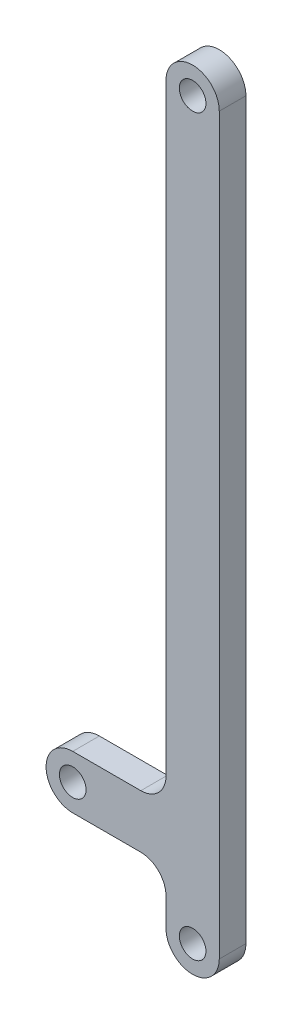
ISO-10303-21;
HEADER;
FILE_DESCRIPTION(('STEP AP214'),'2;1');
FILE_NAME('part.step','',(''),(''),'','','');
FILE_SCHEMA(('AUTOMOTIVE_DESIGN { 1 0 10303 214 1 1 1 1 }'));
ENDSEC;
DATA;
#1=APPLICATION_CONTEXT('core data for automotive mechanical design processes');
#2=APPLICATION_PROTOCOL_DEFINITION('international standard','automotive_design',2000,#1);
#3=PRODUCT_CONTEXT('',#1,'mechanical');
#4=PRODUCT('Part','Part','',(#3));
#5=PRODUCT_RELATED_PRODUCT_CATEGORY('part','',(#4));
#6=PRODUCT_DEFINITION_FORMATION('','',#4);
#7=PRODUCT_DEFINITION_CONTEXT('part definition',#1,'design');
#8=PRODUCT_DEFINITION('design','',#6,#7);
#9=PRODUCT_DEFINITION_SHAPE('','',#8);
#10=(LENGTH_UNIT() NAMED_UNIT(*) SI_UNIT(.MILLI.,.METRE.));
#11=(NAMED_UNIT(*) PLANE_ANGLE_UNIT() SI_UNIT($,.RADIAN.));
#12=(NAMED_UNIT(*) SI_UNIT($,.STERADIAN.) SOLID_ANGLE_UNIT());
#13=UNCERTAINTY_MEASURE_WITH_UNIT(LENGTH_MEASURE(1.E-05),#10,'distance_accuracy_value','');
#14=(GEOMETRIC_REPRESENTATION_CONTEXT(3) GLOBAL_UNCERTAINTY_ASSIGNED_CONTEXT((#13)) GLOBAL_UNIT_ASSIGNED_CONTEXT((#10,
#11,#12)) REPRESENTATION_CONTEXT('',''));
#15=CARTESIAN_POINT('',(0.,0.,0.));
#16=DIRECTION('',(0.,0.,1.));
#17=DIRECTION('',(1.,0.,0.));
#18=AXIS2_PLACEMENT_3D('',#15,#16,#17);
#19=CARTESIAN_POINT('',(0.,0.,12.7));
#20=DIRECTION('',(0.,0.,-1.));
#21=DIRECTION('',(-1.,0.,0.));
#22=AXIS2_PLACEMENT_3D('',#19,#20,#21);
#23=PLANE('',#22);
#24=CARTESIAN_POINT('',(-57.15,-311.912,12.7));
#25=DIRECTION('',(0.,0.,1.));
#26=DIRECTION('',(1.,0.,0.));
#27=AXIS2_PLACEMENT_3D('',#24,#25,#26);
#28=CIRCLE('',#27,6.34999999999999);
#29=CARTESIAN_POINT('',(-50.8,-311.912,12.7));
#30=VERTEX_POINT('',#29);
#31=EDGE_CURVE('E216',#30,#30,#28,.T.);
#32=ORIENTED_EDGE('',*,*,#31,.F.);
#33=EDGE_LOOP('',(#32));
#34=FACE_BOUND('',#33,.T.);
#35=CARTESIAN_POINT('',(0.,0.,12.7));
#36=DIRECTION('',(0.,0.,1.));
#37=DIRECTION('',(-1.,0.,0.));
#38=AXIS2_PLACEMENT_3D('',#35,#36,#37);
#39=CIRCLE('',#38,12.7);
#40=CARTESIAN_POINT('',(12.7000000000001,0.,12.7));
#41=VERTEX_POINT('',#40);
#42=CARTESIAN_POINT('',(-12.6999999999999,0.,12.7));
#43=VERTEX_POINT('',#42);
#44=EDGE_CURVE('E165',#41,#43,#39,.T.);
#45=ORIENTED_EDGE('',*,*,#44,.T.);
#46=DIRECTION('',(0.,-1.,0.));
#47=VECTOR('',#46,1.);
#48=CARTESIAN_POINT('',(-12.6999999999999,0.,12.7));
#49=LINE('',#48,#47);
#50=CARTESIAN_POINT('',(-12.7,-287.212,12.7));
#51=VERTEX_POINT('',#50);
#52=EDGE_CURVE('E103',#43,#51,#49,.T.);
#53=ORIENTED_EDGE('',*,*,#52,.T.);
#54=CARTESIAN_POINT('',(-24.7,-287.212,12.7));
#55=DIRECTION('',(0.,0.,-1.));
#56=DIRECTION('',(1.,0.,0.));
#57=AXIS2_PLACEMENT_3D('',#54,#55,#56);
#58=CIRCLE('',#57,12.);
#59=CARTESIAN_POINT('',(-24.7,-299.212,12.7));
#60=VERTEX_POINT('',#59);
#61=EDGE_CURVE('E186',#51,#60,#58,.T.);
#62=ORIENTED_EDGE('',*,*,#61,.T.);
#63=DIRECTION('',(-1.,0.,0.));
#64=VECTOR('',#63,1.);
#65=CARTESIAN_POINT('',(-24.7,-299.212,12.7));
#66=LINE('',#65,#64);
#67=CARTESIAN_POINT('',(-57.15,-299.212,12.7));
#68=VERTEX_POINT('',#67);
#69=EDGE_CURVE('E205',#60,#68,#66,.T.);
#70=ORIENTED_EDGE('',*,*,#69,.T.);
#71=CARTESIAN_POINT('',(-57.15,-311.912,12.7));
#72=DIRECTION('',(0.,0.,1.));
#73=DIRECTION('',(1.,0.,0.));
#74=AXIS2_PLACEMENT_3D('',#71,#72,#73);
#75=CIRCLE('',#74,12.7);
#76=CARTESIAN_POINT('',(-57.15,-324.612,12.7));
#77=VERTEX_POINT('',#76);
#78=EDGE_CURVE('E202',#68,#77,#75,.T.);
#79=ORIENTED_EDGE('',*,*,#78,.T.);
#80=DIRECTION('',(1.,0.,0.));
#81=VECTOR('',#80,1.);
#82=CARTESIAN_POINT('',(-24.7,-324.612,12.7));
#83=LINE('',#82,#81);
#84=CARTESIAN_POINT('',(-24.7,-324.612,12.7));
#85=VERTEX_POINT('',#84);
#86=EDGE_CURVE('E204',#77,#85,#83,.T.);
#87=ORIENTED_EDGE('',*,*,#86,.T.);
#88=CARTESIAN_POINT('',(-24.7,-336.612,12.7));
#89=DIRECTION('',(0.,0.,-1.));
#90=DIRECTION('',(1.,0.,0.));
#91=AXIS2_PLACEMENT_3D('',#88,#89,#90);
#92=CIRCLE('',#91,12.);
#93=CARTESIAN_POINT('',(-12.7,-336.612,12.7));
#94=VERTEX_POINT('',#93);
#95=EDGE_CURVE('E128',#85,#94,#92,.T.);
#96=ORIENTED_EDGE('',*,*,#95,.T.);
#97=DIRECTION('',(0.,-1.,0.));
#98=VECTOR('',#97,1.);
#99=CARTESIAN_POINT('',(-12.7,-336.612,12.7));
#100=LINE('',#99,#98);
#101=CARTESIAN_POINT('',(-12.7,-350.,12.7));
#102=VERTEX_POINT('',#101);
#103=EDGE_CURVE('E122',#94,#102,#100,.T.);
#104=ORIENTED_EDGE('',*,*,#103,.T.);
#105=CARTESIAN_POINT('',(0.,-350.,12.7));
#106=DIRECTION('',(0.,0.,1.));
#107=DIRECTION('',(1.,0.,0.));
#108=AXIS2_PLACEMENT_3D('',#105,#106,#107);
#109=CIRCLE('',#108,12.7);
#110=CARTESIAN_POINT('',(12.7,-350.,12.7));
#111=VERTEX_POINT('',#110);
#112=EDGE_CURVE('E126',#102,#111,#109,.T.);
#113=ORIENTED_EDGE('',*,*,#112,.T.);
#114=DIRECTION('',(0.,1.,0.));
#115=VECTOR('',#114,1.);
#116=CARTESIAN_POINT('',(12.7000000000001,0.,12.7));
#117=LINE('',#116,#115);
#118=EDGE_CURVE('E54',#111,#41,#117,.T.);
#119=ORIENTED_EDGE('',*,*,#118,.T.);
#120=EDGE_LOOP('',(#45,#53,#62,#70,#79,#87,#96,#104,#113,#119));
#121=FACE_BOUND('',#120,.T.);
#122=CARTESIAN_POINT('',(0.,0.,12.7));
#123=DIRECTION('',(0.,0.,1.));
#124=DIRECTION('',(1.,0.,0.));
#125=AXIS2_PLACEMENT_3D('',#122,#123,#124);
#126=CIRCLE('',#125,6.35);
#127=CARTESIAN_POINT('',(6.35000000000006,0.,12.7));
#128=VERTEX_POINT('',#127);
#129=EDGE_CURVE('E150',#128,#128,#126,.T.);
#130=ORIENTED_EDGE('',*,*,#129,.F.);
#131=EDGE_LOOP('',(#130));
#132=FACE_BOUND('',#131,.T.);
#133=CARTESIAN_POINT('',(0.,-350.,12.7));
#134=DIRECTION('',(0.,0.,1.));
#135=DIRECTION('',(1.,0.,0.));
#136=AXIS2_PLACEMENT_3D('',#133,#134,#135);
#137=CIRCLE('',#136,6.35);
#138=CARTESIAN_POINT('',(6.35,-350.,12.7));
#139=VERTEX_POINT('',#138);
#140=EDGE_CURVE('E222',#139,#139,#137,.T.);
#141=ORIENTED_EDGE('',*,*,#140,.F.);
#142=EDGE_LOOP('',(#141));
#143=FACE_BOUND('',#142,.T.);
#144=ADVANCED_FACE('F37',(#34,#121,#132,#143),#23,.F.);
#145=CARTESIAN_POINT('',(0.,0.,0.));
#146=DIRECTION('',(0.,0.,-1.));
#147=DIRECTION('',(-1.,0.,0.));
#148=AXIS2_PLACEMENT_3D('',#145,#146,#147);
#149=PLANE('',#148);
#150=CARTESIAN_POINT('',(-57.15,-311.912,0.));
#151=DIRECTION('',(0.,0.,1.));
#152=DIRECTION('',(1.,0.,0.));
#153=AXIS2_PLACEMENT_3D('',#150,#151,#152);
#154=CIRCLE('',#153,6.34999999999999);
#155=CARTESIAN_POINT('',(-50.8,-311.912,0.));
#156=VERTEX_POINT('',#155);
#157=EDGE_CURVE('E219',#156,#156,#154,.T.);
#158=ORIENTED_EDGE('',*,*,#157,.T.);
#159=EDGE_LOOP('',(#158));
#160=FACE_BOUND('',#159,.T.);
#161=CARTESIAN_POINT('',(0.,0.,0.));
#162=DIRECTION('',(0.,0.,1.));
#163=DIRECTION('',(-1.,0.,0.));
#164=AXIS2_PLACEMENT_3D('',#161,#162,#163);
#165=CIRCLE('',#164,12.7);
#166=CARTESIAN_POINT('',(12.7000000000001,0.,0.));
#167=VERTEX_POINT('',#166);
#168=CARTESIAN_POINT('',(-12.6999999999999,0.,0.));
#169=VERTEX_POINT('',#168);
#170=EDGE_CURVE('E146',#167,#169,#165,.T.);
#171=ORIENTED_EDGE('',*,*,#170,.F.);
#172=DIRECTION('',(0.,1.,0.));
#173=VECTOR('',#172,1.);
#174=CARTESIAN_POINT('',(12.7000000000001,0.,0.));
#175=LINE('',#174,#173);
#176=CARTESIAN_POINT('',(12.7,-350.,0.));
#177=VERTEX_POINT('',#176);
#178=EDGE_CURVE('E95',#177,#167,#175,.T.);
#179=ORIENTED_EDGE('',*,*,#178,.F.);
#180=CARTESIAN_POINT('',(0.,-350.,0.));
#181=DIRECTION('',(0.,0.,1.));
#182=DIRECTION('',(1.,0.,0.));
#183=AXIS2_PLACEMENT_3D('',#180,#181,#182);
#184=CIRCLE('',#183,12.7);
#185=CARTESIAN_POINT('',(-12.7,-350.,0.));
#186=VERTEX_POINT('',#185);
#187=EDGE_CURVE('E89',#186,#177,#184,.T.);
#188=ORIENTED_EDGE('',*,*,#187,.F.);
#189=DIRECTION('',(0.,-1.,0.));
#190=VECTOR('',#189,1.);
#191=CARTESIAN_POINT('',(-12.7,-336.612,0.));
#192=LINE('',#191,#190);
#193=CARTESIAN_POINT('',(-12.7,-336.612,0.));
#194=VERTEX_POINT('',#193);
#195=EDGE_CURVE('E136',#194,#186,#192,.T.);
#196=ORIENTED_EDGE('',*,*,#195,.F.);
#197=CARTESIAN_POINT('',(-24.7,-336.612,0.));
#198=DIRECTION('',(0.,0.,-1.));
#199=DIRECTION('',(1.,0.,0.));
#200=AXIS2_PLACEMENT_3D('',#197,#198,#199);
#201=CIRCLE('',#200,12.);
#202=CARTESIAN_POINT('',(-24.7,-324.612,0.));
#203=VERTEX_POINT('',#202);
#204=EDGE_CURVE('E160',#203,#194,#201,.T.);
#205=ORIENTED_EDGE('',*,*,#204,.F.);
#206=DIRECTION('',(1.,0.,0.));
#207=VECTOR('',#206,1.);
#208=CARTESIAN_POINT('',(-24.7,-324.612,0.));
#209=LINE('',#208,#207);
#210=CARTESIAN_POINT('',(-57.15,-324.612,0.));
#211=VERTEX_POINT('',#210);
#212=EDGE_CURVE('E158',#211,#203,#209,.T.);
#213=ORIENTED_EDGE('',*,*,#212,.F.);
#214=CARTESIAN_POINT('',(-57.15,-311.912,0.));
#215=DIRECTION('',(0.,0.,1.));
#216=DIRECTION('',(1.,0.,0.));
#217=AXIS2_PLACEMENT_3D('',#214,#215,#216);
#218=CIRCLE('',#217,12.7);
#219=CARTESIAN_POINT('',(-57.15,-299.212,0.));
#220=VERTEX_POINT('',#219);
#221=EDGE_CURVE('E156',#220,#211,#218,.T.);
#222=ORIENTED_EDGE('',*,*,#221,.F.);
#223=DIRECTION('',(-1.,0.,0.));
#224=VECTOR('',#223,1.);
#225=CARTESIAN_POINT('',(-24.7,-299.212,0.));
#226=LINE('',#225,#224);
#227=CARTESIAN_POINT('',(-24.7,-299.212,0.));
#228=VERTEX_POINT('',#227);
#229=EDGE_CURVE('E154',#228,#220,#226,.T.);
#230=ORIENTED_EDGE('',*,*,#229,.F.);
#231=CARTESIAN_POINT('',(-24.7,-287.212,0.));
#232=DIRECTION('',(0.,0.,-1.));
#233=DIRECTION('',(1.,0.,0.));
#234=AXIS2_PLACEMENT_3D('',#231,#232,#233);
#235=CIRCLE('',#234,12.);
#236=CARTESIAN_POINT('',(-12.7,-287.212,0.));
#237=VERTEX_POINT('',#236);
#238=EDGE_CURVE('E152',#237,#228,#235,.T.);
#239=ORIENTED_EDGE('',*,*,#238,.F.);
#240=DIRECTION('',(0.,-1.,0.));
#241=VECTOR('',#240,1.);
#242=CARTESIAN_POINT('',(-12.6999999999999,0.,0.));
#243=LINE('',#242,#241);
#244=EDGE_CURVE('E149',#169,#237,#243,.T.);
#245=ORIENTED_EDGE('',*,*,#244,.F.);
#246=EDGE_LOOP('',(#171,#179,#188,#196,#205,#213,#222,#230,#239,#245));
#247=FACE_BOUND('',#246,.T.);
#248=CARTESIAN_POINT('',(0.,0.,0.));
#249=DIRECTION('',(0.,0.,1.));
#250=DIRECTION('',(1.,0.,0.));
#251=AXIS2_PLACEMENT_3D('',#248,#249,#250);
#252=CIRCLE('',#251,6.35);
#253=CARTESIAN_POINT('',(6.35000000000006,0.,0.));
#254=VERTEX_POINT('',#253);
#255=EDGE_CURVE('E213',#254,#254,#252,.T.);
#256=ORIENTED_EDGE('',*,*,#255,.T.);
#257=EDGE_LOOP('',(#256));
#258=FACE_BOUND('',#257,.T.);
#259=CARTESIAN_POINT('',(0.,-350.,0.));
#260=DIRECTION('',(0.,0.,1.));
#261=DIRECTION('',(1.,0.,0.));
#262=AXIS2_PLACEMENT_3D('',#259,#260,#261);
#263=CIRCLE('',#262,6.35);
#264=CARTESIAN_POINT('',(6.35,-350.,0.));
#265=VERTEX_POINT('',#264);
#266=EDGE_CURVE('E225',#265,#265,#263,.T.);
#267=ORIENTED_EDGE('',*,*,#266,.T.);
#268=EDGE_LOOP('',(#267));
#269=FACE_BOUND('',#268,.T.);
#270=ADVANCED_FACE('F190',(#160,#247,#258,#269),#149,.T.);
#271=CARTESIAN_POINT('',(0.,0.,12.7));
#272=DIRECTION('',(0.,0.,-1.));
#273=DIRECTION('',(-1.,0.,0.));
#274=AXIS2_PLACEMENT_3D('',#271,#272,#273);
#275=CYLINDRICAL_SURFACE('',#274,12.7);
#276=ORIENTED_EDGE('',*,*,#170,.T.);
#277=DIRECTION('',(0.,0.,-1.));
#278=VECTOR('',#277,1.);
#279=CARTESIAN_POINT('',(-12.6999999999999,0.,12.7));
#280=LINE('',#279,#278);
#281=EDGE_CURVE('E11',#43,#169,#280,.T.);
#282=ORIENTED_EDGE('',*,*,#281,.F.);
#283=ORIENTED_EDGE('',*,*,#44,.F.);
#284=DIRECTION('',(0.,0.,-1.));
#285=VECTOR('',#284,1.);
#286=CARTESIAN_POINT('',(12.7000000000001,0.,12.7));
#287=LINE('',#286,#285);
#288=EDGE_CURVE('E142',#41,#167,#287,.T.);
#289=ORIENTED_EDGE('',*,*,#288,.T.);
#290=EDGE_LOOP('',(#276,#282,#283,#289));
#291=FACE_BOUND('',#290,.T.);
#292=ADVANCED_FACE('F39',(#291),#275,.T.);
#293=CARTESIAN_POINT('',(-12.6999999999999,0.,12.7));
#294=DIRECTION('',(1.,0.,0.));
#295=DIRECTION('',(0.,1.,0.));
#296=AXIS2_PLACEMENT_3D('',#293,#294,#295);
#297=PLANE('',#296);
#298=ORIENTED_EDGE('',*,*,#244,.T.);
#299=DIRECTION('',(0.,0.,-1.));
#300=VECTOR('',#299,1.);
#301=CARTESIAN_POINT('',(-12.7,-287.212,12.7));
#302=LINE('',#301,#300);
#303=EDGE_CURVE('E46',#51,#237,#302,.T.);
#304=ORIENTED_EDGE('',*,*,#303,.F.);
#305=ORIENTED_EDGE('',*,*,#52,.F.);
#306=ORIENTED_EDGE('',*,*,#281,.T.);
#307=EDGE_LOOP('',(#298,#304,#305,#306));
#308=FACE_BOUND('',#307,.T.);
#309=ADVANCED_FACE('F267',(#308),#297,.F.);
#310=CARTESIAN_POINT('',(-24.7,-287.212,12.7));
#311=DIRECTION('',(0.,0.,-1.));
#312=DIRECTION('',(-1.,0.,0.));
#313=AXIS2_PLACEMENT_3D('',#310,#311,#312);
#314=CYLINDRICAL_SURFACE('',#313,12.);
#315=ORIENTED_EDGE('',*,*,#238,.T.);
#316=DIRECTION('',(0.,0.,-1.));
#317=VECTOR('',#316,1.);
#318=CARTESIAN_POINT('',(-24.7,-299.212,12.7));
#319=LINE('',#318,#317);
#320=EDGE_CURVE('E178',#60,#228,#319,.T.);
#321=ORIENTED_EDGE('',*,*,#320,.F.);
#322=ORIENTED_EDGE('',*,*,#61,.F.);
#323=ORIENTED_EDGE('',*,*,#303,.T.);
#324=EDGE_LOOP('',(#315,#321,#322,#323));
#325=FACE_BOUND('',#324,.T.);
#326=ADVANCED_FACE('F184',(#325),#314,.F.);
#327=CARTESIAN_POINT('',(-24.7,-299.212,12.7));
#328=DIRECTION('',(0.,-1.,0.));
#329=DIRECTION('',(1.,0.,0.));
#330=AXIS2_PLACEMENT_3D('',#327,#328,#329);
#331=PLANE('',#330);
#332=ORIENTED_EDGE('',*,*,#229,.T.);
#333=DIRECTION('',(0.,0.,-1.));
#334=VECTOR('',#333,1.);
#335=CARTESIAN_POINT('',(-57.15,-299.212,12.7));
#336=LINE('',#335,#334);
#337=EDGE_CURVE('E175',#68,#220,#336,.T.);
#338=ORIENTED_EDGE('',*,*,#337,.F.);
#339=ORIENTED_EDGE('',*,*,#69,.F.);
#340=ORIENTED_EDGE('',*,*,#320,.T.);
#341=EDGE_LOOP('',(#332,#338,#339,#340));
#342=FACE_BOUND('',#341,.T.);
#343=ADVANCED_FACE('F196',(#342),#331,.F.);
#344=CARTESIAN_POINT('',(-57.15,-311.912,12.7));
#345=DIRECTION('',(0.,0.,-1.));
#346=DIRECTION('',(-1.,0.,0.));
#347=AXIS2_PLACEMENT_3D('',#344,#345,#346);
#348=CYLINDRICAL_SURFACE('',#347,12.7);
#349=ORIENTED_EDGE('',*,*,#221,.T.);
#350=DIRECTION('',(0.,0.,-1.));
#351=VECTOR('',#350,1.);
#352=CARTESIAN_POINT('',(-57.15,-324.612,12.7));
#353=LINE('',#352,#351);
#354=EDGE_CURVE('E172',#77,#211,#353,.T.);
#355=ORIENTED_EDGE('',*,*,#354,.F.);
#356=ORIENTED_EDGE('',*,*,#78,.F.);
#357=ORIENTED_EDGE('',*,*,#337,.T.);
#358=EDGE_LOOP('',(#349,#355,#356,#357));
#359=FACE_BOUND('',#358,.T.);
#360=ADVANCED_FACE('F200',(#359),#348,.T.);
#361=CARTESIAN_POINT('',(-24.7,-324.612,12.7));
#362=DIRECTION('',(0.,1.,0.));
#363=DIRECTION('',(0.,0.,1.));
#364=AXIS2_PLACEMENT_3D('',#361,#362,#363);
#365=PLANE('',#364);
#366=ORIENTED_EDGE('',*,*,#212,.T.);
#367=DIRECTION('',(0.,0.,-1.));
#368=VECTOR('',#367,1.);
#369=CARTESIAN_POINT('',(-24.7,-324.612,12.7));
#370=LINE('',#369,#368);
#371=EDGE_CURVE('E169',#85,#203,#370,.T.);
#372=ORIENTED_EDGE('',*,*,#371,.F.);
#373=ORIENTED_EDGE('',*,*,#86,.F.);
#374=ORIENTED_EDGE('',*,*,#354,.T.);
#375=EDGE_LOOP('',(#366,#372,#373,#374));
#376=FACE_BOUND('',#375,.T.);
#377=ADVANCED_FACE('F257',(#376),#365,.F.);
#378=CARTESIAN_POINT('',(-24.7,-336.612,12.7));
#379=DIRECTION('',(0.,0.,-1.));
#380=DIRECTION('',(-1.,0.,0.));
#381=AXIS2_PLACEMENT_3D('',#378,#379,#380);
#382=CYLINDRICAL_SURFACE('',#381,12.);
#383=ORIENTED_EDGE('',*,*,#204,.T.);
#384=DIRECTION('',(0.,0.,-1.));
#385=VECTOR('',#384,1.);
#386=CARTESIAN_POINT('',(-12.7,-336.612,12.7));
#387=LINE('',#386,#385);
#388=EDGE_CURVE('E137',#94,#194,#387,.T.);
#389=ORIENTED_EDGE('',*,*,#388,.F.);
#390=ORIENTED_EDGE('',*,*,#95,.F.);
#391=ORIENTED_EDGE('',*,*,#371,.T.);
#392=EDGE_LOOP('',(#383,#389,#390,#391));
#393=FACE_BOUND('',#392,.T.);
#394=ADVANCED_FACE('F254',(#393),#382,.F.);
#395=CARTESIAN_POINT('',(-12.7,-336.612,12.7));
#396=DIRECTION('',(1.,0.,0.));
#397=DIRECTION('',(0.,1.,0.));
#398=AXIS2_PLACEMENT_3D('',#395,#396,#397);
#399=PLANE('',#398);
#400=ORIENTED_EDGE('',*,*,#195,.T.);
#401=DIRECTION('',(0.,0.,-1.));
#402=VECTOR('',#401,1.);
#403=CARTESIAN_POINT('',(-12.7,-350.,12.7));
#404=LINE('',#403,#402);
#405=EDGE_CURVE('E133',#102,#186,#404,.T.);
#406=ORIENTED_EDGE('',*,*,#405,.F.);
#407=ORIENTED_EDGE('',*,*,#103,.F.);
#408=ORIENTED_EDGE('',*,*,#388,.T.);
#409=EDGE_LOOP('',(#400,#406,#407,#408));
#410=FACE_BOUND('',#409,.T.);
#411=ADVANCED_FACE('F134',(#410),#399,.F.);
#412=CARTESIAN_POINT('',(0.,-350.,12.7));
#413=DIRECTION('',(0.,0.,-1.));
#414=DIRECTION('',(-1.,0.,0.));
#415=AXIS2_PLACEMENT_3D('',#412,#413,#414);
#416=CYLINDRICAL_SURFACE('',#415,12.7);
#417=ORIENTED_EDGE('',*,*,#187,.T.);
#418=DIRECTION('',(0.,0.,-1.));
#419=VECTOR('',#418,1.);
#420=CARTESIAN_POINT('',(12.7,-350.,12.7));
#421=LINE('',#420,#419);
#422=EDGE_CURVE('E138',#111,#177,#421,.T.);
#423=ORIENTED_EDGE('',*,*,#422,.F.);
#424=ORIENTED_EDGE('',*,*,#112,.F.);
#425=ORIENTED_EDGE('',*,*,#405,.T.);
#426=EDGE_LOOP('',(#417,#423,#424,#425));
#427=FACE_BOUND('',#426,.T.);
#428=ADVANCED_FACE('F140',(#427),#416,.T.);
#429=CARTESIAN_POINT('',(12.7000000000001,0.,12.7));
#430=DIRECTION('',(-1.,0.,0.));
#431=DIRECTION('',(0.,-1.,0.));
#432=AXIS2_PLACEMENT_3D('',#429,#430,#431);
#433=PLANE('',#432);
#434=ORIENTED_EDGE('',*,*,#178,.T.);
#435=ORIENTED_EDGE('',*,*,#288,.F.);
#436=ORIENTED_EDGE('',*,*,#118,.F.);
#437=ORIENTED_EDGE('',*,*,#422,.T.);
#438=EDGE_LOOP('',(#434,#435,#436,#437));
#439=FACE_BOUND('',#438,.T.);
#440=ADVANCED_FACE('F247',(#439),#433,.F.);
#441=CARTESIAN_POINT('',(0.,0.,12.7));
#442=DIRECTION('',(0.,0.,-1.));
#443=DIRECTION('',(-1.,0.,0.));
#444=AXIS2_PLACEMENT_3D('',#441,#442,#443);
#445=CYLINDRICAL_SURFACE('',#444,6.35);
#446=ORIENTED_EDGE('',*,*,#129,.T.);
#447=EDGE_LOOP('',(#446));
#448=FACE_BOUND('',#447,.T.);
#449=ORIENTED_EDGE('',*,*,#255,.F.);
#450=EDGE_LOOP('',(#449));
#451=FACE_BOUND('',#450,.T.);
#452=ADVANCED_FACE('F244',(#448,#451),#445,.F.);
#453=CARTESIAN_POINT('',(-57.15,-311.912,12.7));
#454=DIRECTION('',(0.,0.,-1.));
#455=DIRECTION('',(-1.,0.,0.));
#456=AXIS2_PLACEMENT_3D('',#453,#454,#455);
#457=CYLINDRICAL_SURFACE('',#456,6.34999999999999);
#458=ORIENTED_EDGE('',*,*,#31,.T.);
#459=EDGE_LOOP('',(#458));
#460=FACE_BOUND('',#459,.T.);
#461=ORIENTED_EDGE('',*,*,#157,.F.);
#462=EDGE_LOOP('',(#461));
#463=FACE_BOUND('',#462,.T.);
#464=ADVANCED_FACE('F343',(#460,#463),#457,.F.);
#465=CARTESIAN_POINT('',(0.,-350.,12.7));
#466=DIRECTION('',(0.,0.,-1.));
#467=DIRECTION('',(-1.,0.,0.));
#468=AXIS2_PLACEMENT_3D('',#465,#466,#467);
#469=CYLINDRICAL_SURFACE('',#468,6.35);
#470=ORIENTED_EDGE('',*,*,#140,.T.);
#471=EDGE_LOOP('',(#470));
#472=FACE_BOUND('',#471,.T.);
#473=ORIENTED_EDGE('',*,*,#266,.F.);
#474=EDGE_LOOP('',(#473));
#475=FACE_BOUND('',#474,.T.);
#476=ADVANCED_FACE('F231',(#472,#475),#469,.F.);
#477=CLOSED_SHELL('',(#144,#270,#292,#309,#326,#343,#360,#377,#394,#411,#428,#440,#452,#464,#476));
#478=MANIFOLD_SOLID_BREP('B2',#477);
#479=ADVANCED_BREP_SHAPE_REPRESENTATION('',(#18,#478),#14);
#480=SHAPE_DEFINITION_REPRESENTATION(#9,#479);
ENDSEC;
END-ISO-10303-21;
